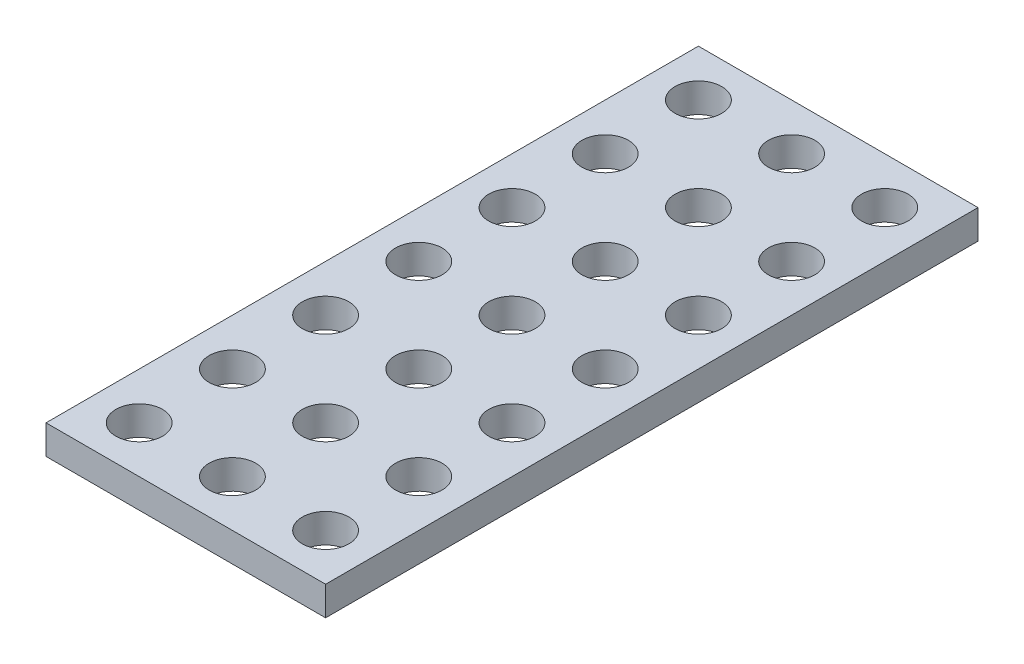
ISO-10303-21;
HEADER;
FILE_DESCRIPTION(('STEP AP214'),'2;1');
FILE_NAME('part.step','',(''),(''),'','','');
FILE_SCHEMA(('AUTOMOTIVE_DESIGN { 1 0 10303 214 1 1 1 1 }'));
ENDSEC;
DATA;
#1=APPLICATION_CONTEXT('core data for automotive mechanical design processes');
#2=APPLICATION_PROTOCOL_DEFINITION('international standard','automotive_design',2000,#1);
#3=PRODUCT_CONTEXT('',#1,'mechanical');
#4=PRODUCT('Part','Part','',(#3));
#5=PRODUCT_RELATED_PRODUCT_CATEGORY('part','',(#4));
#6=PRODUCT_DEFINITION_FORMATION('','',#4);
#7=PRODUCT_DEFINITION_CONTEXT('part definition',#1,'design');
#8=PRODUCT_DEFINITION('design','',#6,#7);
#9=PRODUCT_DEFINITION_SHAPE('','',#8);
#10=(LENGTH_UNIT() NAMED_UNIT(*) SI_UNIT(.MILLI.,.METRE.));
#11=(NAMED_UNIT(*) PLANE_ANGLE_UNIT() SI_UNIT($,.RADIAN.));
#12=(NAMED_UNIT(*) SI_UNIT($,.STERADIAN.) SOLID_ANGLE_UNIT());
#13=UNCERTAINTY_MEASURE_WITH_UNIT(LENGTH_MEASURE(1.E-05),#10,'distance_accuracy_value','');
#14=(GEOMETRIC_REPRESENTATION_CONTEXT(3) GLOBAL_UNCERTAINTY_ASSIGNED_CONTEXT((#13)) GLOBAL_UNIT_ASSIGNED_CONTEXT((#10,
#11,#12)) REPRESENTATION_CONTEXT('',''));
#15=CARTESIAN_POINT('',(0.,0.,0.));
#16=DIRECTION('',(0.,0.,1.));
#17=DIRECTION('',(1.,0.,0.));
#18=AXIS2_PLACEMENT_3D('',#15,#16,#17);
#19=CARTESIAN_POINT('',(0.,2.5,0.));
#20=DIRECTION('',(0.,1.,0.));
#21=DIRECTION('',(0.,0.,1.));
#22=AXIS2_PLACEMENT_3D('',#19,#20,#21);
#23=PLANE('',#22);
#24=CARTESIAN_POINT('',(16.,2.5,48.));
#25=DIRECTION('',(0.,-1.,0.));
#26=DIRECTION('',(0.,0.,-1.));
#27=AXIS2_PLACEMENT_3D('',#24,#25,#26);
#28=CIRCLE('',#27,2.);
#29=CARTESIAN_POINT('',(16.,2.5,46.));
#30=VERTEX_POINT('',#29);
#31=EDGE_CURVE('E139',#30,#30,#28,.T.);
#32=ORIENTED_EDGE('',*,*,#31,.T.);
#33=EDGE_LOOP('',(#32));
#34=FACE_BOUND('',#33,.T.);
#35=CARTESIAN_POINT('',(16.,2.5,40.));
#36=DIRECTION('',(0.,-1.,0.));
#37=DIRECTION('',(0.,0.,-1.));
#38=AXIS2_PLACEMENT_3D('',#35,#36,#37);
#39=CIRCLE('',#38,2.);
#40=CARTESIAN_POINT('',(16.,2.5,38.));
#41=VERTEX_POINT('',#40);
#42=EDGE_CURVE('E142',#41,#41,#39,.T.);
#43=ORIENTED_EDGE('',*,*,#42,.T.);
#44=EDGE_LOOP('',(#43));
#45=FACE_BOUND('',#44,.T.);
#46=CARTESIAN_POINT('',(16.,2.5,32.));
#47=DIRECTION('',(0.,-1.,0.));
#48=DIRECTION('',(0.,0.,-1.));
#49=AXIS2_PLACEMENT_3D('',#46,#47,#48);
#50=CIRCLE('',#49,2.);
#51=CARTESIAN_POINT('',(16.,2.5,30.));
#52=VERTEX_POINT('',#51);
#53=EDGE_CURVE('E145',#52,#52,#50,.T.);
#54=ORIENTED_EDGE('',*,*,#53,.T.);
#55=EDGE_LOOP('',(#54));
#56=FACE_BOUND('',#55,.T.);
#57=CARTESIAN_POINT('',(16.,2.5,24.));
#58=DIRECTION('',(0.,-1.,0.));
#59=DIRECTION('',(0.,0.,-1.));
#60=AXIS2_PLACEMENT_3D('',#57,#58,#59);
#61=CIRCLE('',#60,2.);
#62=CARTESIAN_POINT('',(16.,2.5,22.));
#63=VERTEX_POINT('',#62);
#64=EDGE_CURVE('E148',#63,#63,#61,.T.);
#65=ORIENTED_EDGE('',*,*,#64,.T.);
#66=EDGE_LOOP('',(#65));
#67=FACE_BOUND('',#66,.T.);
#68=CARTESIAN_POINT('',(16.,2.5,16.));
#69=DIRECTION('',(0.,-1.,0.));
#70=DIRECTION('',(0.,0.,-1.));
#71=AXIS2_PLACEMENT_3D('',#68,#69,#70);
#72=CIRCLE('',#71,2.);
#73=CARTESIAN_POINT('',(16.,2.5,14.));
#74=VERTEX_POINT('',#73);
#75=EDGE_CURVE('E151',#74,#74,#72,.T.);
#76=ORIENTED_EDGE('',*,*,#75,.T.);
#77=EDGE_LOOP('',(#76));
#78=FACE_BOUND('',#77,.T.);
#79=CARTESIAN_POINT('',(16.,2.5,8.));
#80=DIRECTION('',(0.,-1.,0.));
#81=DIRECTION('',(0.,0.,-1.));
#82=AXIS2_PLACEMENT_3D('',#79,#80,#81);
#83=CIRCLE('',#82,2.);
#84=CARTESIAN_POINT('',(16.,2.5,6.));
#85=VERTEX_POINT('',#84);
#86=EDGE_CURVE('E154',#85,#85,#83,.T.);
#87=ORIENTED_EDGE('',*,*,#86,.T.);
#88=EDGE_LOOP('',(#87));
#89=FACE_BOUND('',#88,.T.);
#90=CARTESIAN_POINT('',(16.,2.5,0.));
#91=DIRECTION('',(0.,-1.,0.));
#92=DIRECTION('',(0.,0.,-1.));
#93=AXIS2_PLACEMENT_3D('',#90,#91,#92);
#94=CIRCLE('',#93,2.);
#95=CARTESIAN_POINT('',(16.,2.5,-2.));
#96=VERTEX_POINT('',#95);
#97=EDGE_CURVE('E157',#96,#96,#94,.T.);
#98=ORIENTED_EDGE('',*,*,#97,.T.);
#99=EDGE_LOOP('',(#98));
#100=FACE_BOUND('',#99,.T.);
#101=CARTESIAN_POINT('',(8.00000000000001,2.5,48.));
#102=DIRECTION('',(0.,-1.,0.));
#103=DIRECTION('',(0.,0.,-1.));
#104=AXIS2_PLACEMENT_3D('',#101,#102,#103);
#105=CIRCLE('',#104,2.);
#106=CARTESIAN_POINT('',(8.00000000000001,2.5,46.));
#107=VERTEX_POINT('',#106);
#108=EDGE_CURVE('E160',#107,#107,#105,.T.);
#109=ORIENTED_EDGE('',*,*,#108,.T.);
#110=EDGE_LOOP('',(#109));
#111=FACE_BOUND('',#110,.T.);
#112=CARTESIAN_POINT('',(8.,2.5,40.));
#113=DIRECTION('',(0.,-1.,0.));
#114=DIRECTION('',(0.,0.,-1.));
#115=AXIS2_PLACEMENT_3D('',#112,#113,#114);
#116=CIRCLE('',#115,2.);
#117=CARTESIAN_POINT('',(8.,2.5,38.));
#118=VERTEX_POINT('',#117);
#119=EDGE_CURVE('E163',#118,#118,#116,.T.);
#120=ORIENTED_EDGE('',*,*,#119,.T.);
#121=EDGE_LOOP('',(#120));
#122=FACE_BOUND('',#121,.T.);
#123=CARTESIAN_POINT('',(8.,2.5,32.));
#124=DIRECTION('',(0.,-1.,0.));
#125=DIRECTION('',(0.,0.,-1.));
#126=AXIS2_PLACEMENT_3D('',#123,#124,#125);
#127=CIRCLE('',#126,2.);
#128=CARTESIAN_POINT('',(8.,2.5,30.));
#129=VERTEX_POINT('',#128);
#130=EDGE_CURVE('E166',#129,#129,#127,.T.);
#131=ORIENTED_EDGE('',*,*,#130,.T.);
#132=EDGE_LOOP('',(#131));
#133=FACE_BOUND('',#132,.T.);
#134=CARTESIAN_POINT('',(8.,2.5,24.));
#135=DIRECTION('',(0.,-1.,0.));
#136=DIRECTION('',(0.,0.,-1.));
#137=AXIS2_PLACEMENT_3D('',#134,#135,#136);
#138=CIRCLE('',#137,2.);
#139=CARTESIAN_POINT('',(8.,2.5,22.));
#140=VERTEX_POINT('',#139);
#141=EDGE_CURVE('E169',#140,#140,#138,.T.);
#142=ORIENTED_EDGE('',*,*,#141,.T.);
#143=EDGE_LOOP('',(#142));
#144=FACE_BOUND('',#143,.T.);
#145=CARTESIAN_POINT('',(8.,2.5,16.));
#146=DIRECTION('',(0.,-1.,0.));
#147=DIRECTION('',(0.,0.,-1.));
#148=AXIS2_PLACEMENT_3D('',#145,#146,#147);
#149=CIRCLE('',#148,2.);
#150=CARTESIAN_POINT('',(8.,2.5,14.));
#151=VERTEX_POINT('',#150);
#152=EDGE_CURVE('E172',#151,#151,#149,.T.);
#153=ORIENTED_EDGE('',*,*,#152,.T.);
#154=EDGE_LOOP('',(#153));
#155=FACE_BOUND('',#154,.T.);
#156=CARTESIAN_POINT('',(8.,2.5,8.));
#157=DIRECTION('',(0.,-1.,0.));
#158=DIRECTION('',(0.,0.,-1.));
#159=AXIS2_PLACEMENT_3D('',#156,#157,#158);
#160=CIRCLE('',#159,2.);
#161=CARTESIAN_POINT('',(8.,2.5,6.));
#162=VERTEX_POINT('',#161);
#163=EDGE_CURVE('E175',#162,#162,#160,.T.);
#164=ORIENTED_EDGE('',*,*,#163,.T.);
#165=EDGE_LOOP('',(#164));
#166=FACE_BOUND('',#165,.T.);
#167=CARTESIAN_POINT('',(8.,2.5,0.));
#168=DIRECTION('',(0.,-1.,0.));
#169=DIRECTION('',(0.,0.,-1.));
#170=AXIS2_PLACEMENT_3D('',#167,#168,#169);
#171=CIRCLE('',#170,2.);
#172=CARTESIAN_POINT('',(8.,2.5,-2.));
#173=VERTEX_POINT('',#172);
#174=EDGE_CURVE('E178',#173,#173,#171,.T.);
#175=ORIENTED_EDGE('',*,*,#174,.T.);
#176=EDGE_LOOP('',(#175));
#177=FACE_BOUND('',#176,.T.);
#178=CARTESIAN_POINT('',(0.,2.5,48.));
#179=DIRECTION('',(0.,-1.,0.));
#180=DIRECTION('',(0.,0.,-1.));
#181=AXIS2_PLACEMENT_3D('',#178,#179,#180);
#182=CIRCLE('',#181,2.);
#183=CARTESIAN_POINT('',(0.,2.5,46.));
#184=VERTEX_POINT('',#183);
#185=EDGE_CURVE('E181',#184,#184,#182,.T.);
#186=ORIENTED_EDGE('',*,*,#185,.T.);
#187=EDGE_LOOP('',(#186));
#188=FACE_BOUND('',#187,.T.);
#189=CARTESIAN_POINT('',(0.,2.5,40.));
#190=DIRECTION('',(0.,-1.,0.));
#191=DIRECTION('',(0.,0.,-1.));
#192=AXIS2_PLACEMENT_3D('',#189,#190,#191);
#193=CIRCLE('',#192,2.);
#194=CARTESIAN_POINT('',(0.,2.5,38.));
#195=VERTEX_POINT('',#194);
#196=EDGE_CURVE('E184',#195,#195,#193,.T.);
#197=ORIENTED_EDGE('',*,*,#196,.T.);
#198=EDGE_LOOP('',(#197));
#199=FACE_BOUND('',#198,.T.);
#200=CARTESIAN_POINT('',(0.,2.5,32.));
#201=DIRECTION('',(0.,-1.,0.));
#202=DIRECTION('',(0.,0.,-1.));
#203=AXIS2_PLACEMENT_3D('',#200,#201,#202);
#204=CIRCLE('',#203,2.);
#205=CARTESIAN_POINT('',(0.,2.5,30.));
#206=VERTEX_POINT('',#205);
#207=EDGE_CURVE('E187',#206,#206,#204,.T.);
#208=ORIENTED_EDGE('',*,*,#207,.T.);
#209=EDGE_LOOP('',(#208));
#210=FACE_BOUND('',#209,.T.);
#211=CARTESIAN_POINT('',(0.,2.5,24.));
#212=DIRECTION('',(0.,-1.,0.));
#213=DIRECTION('',(0.,0.,-1.));
#214=AXIS2_PLACEMENT_3D('',#211,#212,#213);
#215=CIRCLE('',#214,2.);
#216=CARTESIAN_POINT('',(0.,2.5,22.));
#217=VERTEX_POINT('',#216);
#218=EDGE_CURVE('E190',#217,#217,#215,.T.);
#219=ORIENTED_EDGE('',*,*,#218,.T.);
#220=EDGE_LOOP('',(#219));
#221=FACE_BOUND('',#220,.T.);
#222=CARTESIAN_POINT('',(0.,2.5,16.));
#223=DIRECTION('',(0.,-1.,0.));
#224=DIRECTION('',(0.,0.,-1.));
#225=AXIS2_PLACEMENT_3D('',#222,#223,#224);
#226=CIRCLE('',#225,2.);
#227=CARTESIAN_POINT('',(0.,2.5,14.));
#228=VERTEX_POINT('',#227);
#229=EDGE_CURVE('E193',#228,#228,#226,.T.);
#230=ORIENTED_EDGE('',*,*,#229,.T.);
#231=EDGE_LOOP('',(#230));
#232=FACE_BOUND('',#231,.T.);
#233=CARTESIAN_POINT('',(0.,2.5,8.));
#234=DIRECTION('',(0.,-1.,0.));
#235=DIRECTION('',(0.,0.,-1.));
#236=AXIS2_PLACEMENT_3D('',#233,#234,#235);
#237=CIRCLE('',#236,2.);
#238=CARTESIAN_POINT('',(0.,2.5,6.));
#239=VERTEX_POINT('',#238);
#240=EDGE_CURVE('E195',#239,#239,#237,.T.);
#241=ORIENTED_EDGE('',*,*,#240,.T.);
#242=EDGE_LOOP('',(#241));
#243=FACE_BOUND('',#242,.T.);
#244=CARTESIAN_POINT('',(0.,2.5,0.));
#245=DIRECTION('',(0.,-1.,0.));
#246=DIRECTION('',(0.,0.,-1.));
#247=AXIS2_PLACEMENT_3D('',#244,#245,#246);
#248=CIRCLE('',#247,2.);
#249=CARTESIAN_POINT('',(0.,2.5,-2.));
#250=VERTEX_POINT('',#249);
#251=EDGE_CURVE('E19',#250,#250,#248,.T.);
#252=ORIENTED_EDGE('',*,*,#251,.T.);
#253=EDGE_LOOP('',(#252));
#254=FACE_BOUND('',#253,.T.);
#255=DIRECTION('',(0.,0.,-1.));
#256=VECTOR('',#255,1.);
#257=CARTESIAN_POINT('',(-4.,2.5,-4.));
#258=LINE('',#257,#256);
#259=CARTESIAN_POINT('',(-4.,2.5,-4.));
#260=VERTEX_POINT('',#259);
#261=CARTESIAN_POINT('',(-4.,2.5,52.));
#262=VERTEX_POINT('',#261);
#263=EDGE_CURVE('E58',#260,#262,#258,.F.);
#264=ORIENTED_EDGE('',*,*,#263,.T.);
#265=DIRECTION('',(-1.,0.,0.));
#266=VECTOR('',#265,1.);
#267=CARTESIAN_POINT('',(-3.99999999999999,2.5,52.));
#268=LINE('',#267,#266);
#269=CARTESIAN_POINT('',(20.,2.5,52.));
#270=VERTEX_POINT('',#269);
#271=EDGE_CURVE('E55',#262,#270,#268,.F.);
#272=ORIENTED_EDGE('',*,*,#271,.T.);
#273=DIRECTION('',(0.,0.,1.));
#274=VECTOR('',#273,1.);
#275=CARTESIAN_POINT('',(20.,2.5,-4.));
#276=LINE('',#275,#274);
#277=CARTESIAN_POINT('',(20.,2.5,-4.));
#278=VERTEX_POINT('',#277);
#279=EDGE_CURVE('E209',#270,#278,#276,.F.);
#280=ORIENTED_EDGE('',*,*,#279,.T.);
#281=DIRECTION('',(1.,0.,0.));
#282=VECTOR('',#281,1.);
#283=CARTESIAN_POINT('',(-4.,2.5,-4.));
#284=LINE('',#283,#282);
#285=EDGE_CURVE('E59',#278,#260,#284,.F.);
#286=ORIENTED_EDGE('',*,*,#285,.T.);
#287=EDGE_LOOP('',(#264,#272,#280,#286));
#288=FACE_BOUND('',#287,.T.);
#289=ADVANCED_FACE('F16',(#34,#45,#56,#67,#78,#89,#100,#111,#122,#133,#144,#155,#166,#177,#188,
#199,#210,#221,#232,#243,#254,#288),#23,.T.);
#290=CARTESIAN_POINT('',(-4.,2.5,-4.));
#291=DIRECTION('',(1.,0.,0.));
#292=DIRECTION('',(0.,0.,-1.));
#293=AXIS2_PLACEMENT_3D('',#290,#291,#292);
#294=PLANE('',#293);
#295=DIRECTION('',(0.,1.,0.));
#296=VECTOR('',#295,1.);
#297=CARTESIAN_POINT('',(-3.99999999999999,2.5,52.));
#298=LINE('',#297,#296);
#299=CARTESIAN_POINT('',(-4.,0.,52.));
#300=VERTEX_POINT('',#299);
#301=EDGE_CURVE('E64',#300,#262,#298,.T.);
#302=ORIENTED_EDGE('',*,*,#301,.T.);
#303=ORIENTED_EDGE('',*,*,#263,.F.);
#304=DIRECTION('',(0.,1.,0.));
#305=VECTOR('',#304,1.);
#306=CARTESIAN_POINT('',(-4.,2.5,-4.));
#307=LINE('',#306,#305);
#308=CARTESIAN_POINT('',(-4.,0.,-4.));
#309=VERTEX_POINT('',#308);
#310=EDGE_CURVE('E200',#260,#309,#307,.F.);
#311=ORIENTED_EDGE('',*,*,#310,.T.);
#312=DIRECTION('',(0.,0.,1.));
#313=VECTOR('',#312,1.);
#314=CARTESIAN_POINT('',(-4.,0.,0.));
#315=LINE('',#314,#313);
#316=EDGE_CURVE('E75',#309,#300,#315,.T.);
#317=ORIENTED_EDGE('',*,*,#316,.T.);
#318=EDGE_LOOP('',(#302,#303,#311,#317));
#319=FACE_BOUND('',#318,.T.);
#320=ADVANCED_FACE('F74',(#319),#294,.F.);
#321=CARTESIAN_POINT('',(-3.99999999999999,2.5,52.));
#322=DIRECTION('',(0.,0.,-1.));
#323=DIRECTION('',(-1.,0.,0.));
#324=AXIS2_PLACEMENT_3D('',#321,#322,#323);
#325=PLANE('',#324);
#326=DIRECTION('',(0.,1.,0.));
#327=VECTOR('',#326,1.);
#328=CARTESIAN_POINT('',(20.,2.5,52.));
#329=LINE('',#328,#327);
#330=CARTESIAN_POINT('',(20.,0.,52.));
#331=VERTEX_POINT('',#330);
#332=EDGE_CURVE('E71',#331,#270,#329,.T.);
#333=ORIENTED_EDGE('',*,*,#332,.T.);
#334=ORIENTED_EDGE('',*,*,#271,.F.);
#335=ORIENTED_EDGE('',*,*,#301,.F.);
#336=DIRECTION('',(1.,0.,0.));
#337=VECTOR('',#336,1.);
#338=CARTESIAN_POINT('',(0.,0.,52.));
#339=LINE('',#338,#337);
#340=EDGE_CURVE('E217',#300,#331,#339,.T.);
#341=ORIENTED_EDGE('',*,*,#340,.T.);
#342=EDGE_LOOP('',(#333,#334,#335,#341));
#343=FACE_BOUND('',#342,.T.);
#344=ADVANCED_FACE('F68',(#343),#325,.F.);
#345=CARTESIAN_POINT('',(20.,2.5,-4.));
#346=DIRECTION('',(-1.,0.,0.));
#347=DIRECTION('',(0.,0.,1.));
#348=AXIS2_PLACEMENT_3D('',#345,#346,#347);
#349=PLANE('',#348);
#350=DIRECTION('',(0.,1.,0.));
#351=VECTOR('',#350,1.);
#352=CARTESIAN_POINT('',(20.,2.5,-4.));
#353=LINE('',#352,#351);
#354=CARTESIAN_POINT('',(20.,0.,-4.));
#355=VERTEX_POINT('',#354);
#356=EDGE_CURVE('E34',#355,#278,#353,.T.);
#357=ORIENTED_EDGE('',*,*,#356,.T.);
#358=ORIENTED_EDGE('',*,*,#279,.F.);
#359=ORIENTED_EDGE('',*,*,#332,.F.);
#360=DIRECTION('',(0.,0.,1.));
#361=VECTOR('',#360,1.);
#362=CARTESIAN_POINT('',(20.,0.,0.));
#363=LINE('',#362,#361);
#364=EDGE_CURVE('E215',#331,#355,#363,.F.);
#365=ORIENTED_EDGE('',*,*,#364,.T.);
#366=EDGE_LOOP('',(#357,#358,#359,#365));
#367=FACE_BOUND('',#366,.T.);
#368=ADVANCED_FACE('F213',(#367),#349,.F.);
#369=CARTESIAN_POINT('',(-4.,2.5,-4.));
#370=DIRECTION('',(0.,0.,1.));
#371=DIRECTION('',(1.,0.,0.));
#372=AXIS2_PLACEMENT_3D('',#369,#370,#371);
#373=PLANE('',#372);
#374=ORIENTED_EDGE('',*,*,#310,.F.);
#375=ORIENTED_EDGE('',*,*,#285,.F.);
#376=ORIENTED_EDGE('',*,*,#356,.F.);
#377=DIRECTION('',(1.,0.,0.));
#378=VECTOR('',#377,1.);
#379=CARTESIAN_POINT('',(0.,0.,-4.));
#380=LINE('',#379,#378);
#381=EDGE_CURVE('E138',#355,#309,#380,.F.);
#382=ORIENTED_EDGE('',*,*,#381,.T.);
#383=EDGE_LOOP('',(#374,#375,#376,#382));
#384=FACE_BOUND('',#383,.T.);
#385=ADVANCED_FACE('F211',(#384),#373,.F.);
#386=CARTESIAN_POINT('',(0.,2.5,0.));
#387=DIRECTION('',(0.,-1.,0.));
#388=DIRECTION('',(0.,0.,-1.));
#389=AXIS2_PLACEMENT_3D('',#386,#387,#388);
#390=CYLINDRICAL_SURFACE('',#389,2.);
#391=CARTESIAN_POINT('',(0.,0.,0.));
#392=DIRECTION('',(0.,-1.,0.));
#393=DIRECTION('',(0.,0.,-1.));
#394=AXIS2_PLACEMENT_3D('',#391,#392,#393);
#395=CIRCLE('',#394,2.);
#396=CARTESIAN_POINT('',(0.,0.,-2.));
#397=VERTEX_POINT('',#396);
#398=EDGE_CURVE('E135',#397,#397,#395,.T.);
#399=ORIENTED_EDGE('',*,*,#398,.T.);
#400=EDGE_LOOP('',(#399));
#401=FACE_BOUND('',#400,.T.);
#402=ORIENTED_EDGE('',*,*,#251,.F.);
#403=EDGE_LOOP('',(#402));
#404=FACE_BOUND('',#403,.T.);
#405=ADVANCED_FACE('F309',(#401,#404),#390,.F.);
#406=CARTESIAN_POINT('',(0.,2.5,8.));
#407=DIRECTION('',(0.,-1.,0.));
#408=DIRECTION('',(0.,0.,-1.));
#409=AXIS2_PLACEMENT_3D('',#406,#407,#408);
#410=CYLINDRICAL_SURFACE('',#409,2.);
#411=CARTESIAN_POINT('',(0.,0.,8.));
#412=DIRECTION('',(0.,-1.,0.));
#413=DIRECTION('',(0.,0.,-1.));
#414=AXIS2_PLACEMENT_3D('',#411,#412,#413);
#415=CIRCLE('',#414,2.);
#416=CARTESIAN_POINT('',(0.,0.,6.));
#417=VERTEX_POINT('',#416);
#418=EDGE_CURVE('E132',#417,#417,#415,.T.);
#419=ORIENTED_EDGE('',*,*,#418,.T.);
#420=EDGE_LOOP('',(#419));
#421=FACE_BOUND('',#420,.T.);
#422=ORIENTED_EDGE('',*,*,#240,.F.);
#423=EDGE_LOOP('',(#422));
#424=FACE_BOUND('',#423,.T.);
#425=ADVANCED_FACE('F305',(#421,#424),#410,.F.);
#426=CARTESIAN_POINT('',(0.,2.5,16.));
#427=DIRECTION('',(0.,-1.,0.));
#428=DIRECTION('',(0.,0.,-1.));
#429=AXIS2_PLACEMENT_3D('',#426,#427,#428);
#430=CYLINDRICAL_SURFACE('',#429,2.);
#431=CARTESIAN_POINT('',(0.,0.,16.));
#432=DIRECTION('',(0.,-1.,0.));
#433=DIRECTION('',(0.,0.,-1.));
#434=AXIS2_PLACEMENT_3D('',#431,#432,#433);
#435=CIRCLE('',#434,2.);
#436=CARTESIAN_POINT('',(0.,0.,14.));
#437=VERTEX_POINT('',#436);
#438=EDGE_CURVE('E129',#437,#437,#435,.T.);
#439=ORIENTED_EDGE('',*,*,#438,.T.);
#440=EDGE_LOOP('',(#439));
#441=FACE_BOUND('',#440,.T.);
#442=ORIENTED_EDGE('',*,*,#229,.F.);
#443=EDGE_LOOP('',(#442));
#444=FACE_BOUND('',#443,.T.);
#445=ADVANCED_FACE('F301',(#441,#444),#430,.F.);
#446=CARTESIAN_POINT('',(0.,2.5,24.));
#447=DIRECTION('',(0.,-1.,0.));
#448=DIRECTION('',(0.,0.,-1.));
#449=AXIS2_PLACEMENT_3D('',#446,#447,#448);
#450=CYLINDRICAL_SURFACE('',#449,2.);
#451=CARTESIAN_POINT('',(0.,0.,24.));
#452=DIRECTION('',(0.,-1.,0.));
#453=DIRECTION('',(0.,0.,-1.));
#454=AXIS2_PLACEMENT_3D('',#451,#452,#453);
#455=CIRCLE('',#454,2.);
#456=CARTESIAN_POINT('',(0.,0.,22.));
#457=VERTEX_POINT('',#456);
#458=EDGE_CURVE('E126',#457,#457,#455,.T.);
#459=ORIENTED_EDGE('',*,*,#458,.T.);
#460=EDGE_LOOP('',(#459));
#461=FACE_BOUND('',#460,.T.);
#462=ORIENTED_EDGE('',*,*,#218,.F.);
#463=EDGE_LOOP('',(#462));
#464=FACE_BOUND('',#463,.T.);
#465=ADVANCED_FACE('F297',(#461,#464),#450,.F.);
#466=CARTESIAN_POINT('',(0.,2.5,32.));
#467=DIRECTION('',(0.,-1.,0.));
#468=DIRECTION('',(0.,0.,-1.));
#469=AXIS2_PLACEMENT_3D('',#466,#467,#468);
#470=CYLINDRICAL_SURFACE('',#469,2.);
#471=CARTESIAN_POINT('',(0.,0.,32.));
#472=DIRECTION('',(0.,-1.,0.));
#473=DIRECTION('',(0.,0.,-1.));
#474=AXIS2_PLACEMENT_3D('',#471,#472,#473);
#475=CIRCLE('',#474,2.);
#476=CARTESIAN_POINT('',(0.,0.,30.));
#477=VERTEX_POINT('',#476);
#478=EDGE_CURVE('E123',#477,#477,#475,.T.);
#479=ORIENTED_EDGE('',*,*,#478,.T.);
#480=EDGE_LOOP('',(#479));
#481=FACE_BOUND('',#480,.T.);
#482=ORIENTED_EDGE('',*,*,#207,.F.);
#483=EDGE_LOOP('',(#482));
#484=FACE_BOUND('',#483,.T.);
#485=ADVANCED_FACE('F293',(#481,#484),#470,.F.);
#486=CARTESIAN_POINT('',(0.,2.5,40.));
#487=DIRECTION('',(0.,-1.,0.));
#488=DIRECTION('',(0.,0.,-1.));
#489=AXIS2_PLACEMENT_3D('',#486,#487,#488);
#490=CYLINDRICAL_SURFACE('',#489,2.);
#491=CARTESIAN_POINT('',(0.,0.,40.));
#492=DIRECTION('',(0.,-1.,0.));
#493=DIRECTION('',(0.,0.,-1.));
#494=AXIS2_PLACEMENT_3D('',#491,#492,#493);
#495=CIRCLE('',#494,2.);
#496=CARTESIAN_POINT('',(0.,0.,38.));
#497=VERTEX_POINT('',#496);
#498=EDGE_CURVE('E120',#497,#497,#495,.T.);
#499=ORIENTED_EDGE('',*,*,#498,.T.);
#500=EDGE_LOOP('',(#499));
#501=FACE_BOUND('',#500,.T.);
#502=ORIENTED_EDGE('',*,*,#196,.F.);
#503=EDGE_LOOP('',(#502));
#504=FACE_BOUND('',#503,.T.);
#505=ADVANCED_FACE('F289',(#501,#504),#490,.F.);
#506=CARTESIAN_POINT('',(0.,2.5,48.));
#507=DIRECTION('',(0.,-1.,0.));
#508=DIRECTION('',(0.,0.,-1.));
#509=AXIS2_PLACEMENT_3D('',#506,#507,#508);
#510=CYLINDRICAL_SURFACE('',#509,2.);
#511=CARTESIAN_POINT('',(0.,0.,48.));
#512=DIRECTION('',(0.,-1.,0.));
#513=DIRECTION('',(0.,0.,-1.));
#514=AXIS2_PLACEMENT_3D('',#511,#512,#513);
#515=CIRCLE('',#514,2.);
#516=CARTESIAN_POINT('',(0.,0.,46.));
#517=VERTEX_POINT('',#516);
#518=EDGE_CURVE('E117',#517,#517,#515,.T.);
#519=ORIENTED_EDGE('',*,*,#518,.T.);
#520=EDGE_LOOP('',(#519));
#521=FACE_BOUND('',#520,.T.);
#522=ORIENTED_EDGE('',*,*,#185,.F.);
#523=EDGE_LOOP('',(#522));
#524=FACE_BOUND('',#523,.T.);
#525=ADVANCED_FACE('F285',(#521,#524),#510,.F.);
#526=CARTESIAN_POINT('',(8.,2.5,0.));
#527=DIRECTION('',(0.,-1.,0.));
#528=DIRECTION('',(0.,0.,-1.));
#529=AXIS2_PLACEMENT_3D('',#526,#527,#528);
#530=CYLINDRICAL_SURFACE('',#529,2.);
#531=CARTESIAN_POINT('',(8.,0.,0.));
#532=DIRECTION('',(0.,-1.,0.));
#533=DIRECTION('',(0.,0.,-1.));
#534=AXIS2_PLACEMENT_3D('',#531,#532,#533);
#535=CIRCLE('',#534,2.);
#536=CARTESIAN_POINT('',(8.,0.,-2.));
#537=VERTEX_POINT('',#536);
#538=EDGE_CURVE('E114',#537,#537,#535,.T.);
#539=ORIENTED_EDGE('',*,*,#538,.T.);
#540=EDGE_LOOP('',(#539));
#541=FACE_BOUND('',#540,.T.);
#542=ORIENTED_EDGE('',*,*,#174,.F.);
#543=EDGE_LOOP('',(#542));
#544=FACE_BOUND('',#543,.T.);
#545=ADVANCED_FACE('F281',(#541,#544),#530,.F.);
#546=CARTESIAN_POINT('',(8.,2.5,8.));
#547=DIRECTION('',(0.,-1.,0.));
#548=DIRECTION('',(0.,0.,-1.));
#549=AXIS2_PLACEMENT_3D('',#546,#547,#548);
#550=CYLINDRICAL_SURFACE('',#549,2.);
#551=CARTESIAN_POINT('',(8.,0.,8.));
#552=DIRECTION('',(0.,-1.,0.));
#553=DIRECTION('',(0.,0.,-1.));
#554=AXIS2_PLACEMENT_3D('',#551,#552,#553);
#555=CIRCLE('',#554,2.);
#556=CARTESIAN_POINT('',(8.,0.,6.));
#557=VERTEX_POINT('',#556);
#558=EDGE_CURVE('E111',#557,#557,#555,.T.);
#559=ORIENTED_EDGE('',*,*,#558,.T.);
#560=EDGE_LOOP('',(#559));
#561=FACE_BOUND('',#560,.T.);
#562=ORIENTED_EDGE('',*,*,#163,.F.);
#563=EDGE_LOOP('',(#562));
#564=FACE_BOUND('',#563,.T.);
#565=ADVANCED_FACE('F277',(#561,#564),#550,.F.);
#566=CARTESIAN_POINT('',(8.,2.5,16.));
#567=DIRECTION('',(0.,-1.,0.));
#568=DIRECTION('',(0.,0.,-1.));
#569=AXIS2_PLACEMENT_3D('',#566,#567,#568);
#570=CYLINDRICAL_SURFACE('',#569,2.);
#571=CARTESIAN_POINT('',(8.,0.,16.));
#572=DIRECTION('',(0.,-1.,0.));
#573=DIRECTION('',(0.,0.,-1.));
#574=AXIS2_PLACEMENT_3D('',#571,#572,#573);
#575=CIRCLE('',#574,2.);
#576=CARTESIAN_POINT('',(8.,0.,14.));
#577=VERTEX_POINT('',#576);
#578=EDGE_CURVE('E108',#577,#577,#575,.T.);
#579=ORIENTED_EDGE('',*,*,#578,.T.);
#580=EDGE_LOOP('',(#579));
#581=FACE_BOUND('',#580,.T.);
#582=ORIENTED_EDGE('',*,*,#152,.F.);
#583=EDGE_LOOP('',(#582));
#584=FACE_BOUND('',#583,.T.);
#585=ADVANCED_FACE('F273',(#581,#584),#570,.F.);
#586=CARTESIAN_POINT('',(8.,2.5,24.));
#587=DIRECTION('',(0.,-1.,0.));
#588=DIRECTION('',(0.,0.,-1.));
#589=AXIS2_PLACEMENT_3D('',#586,#587,#588);
#590=CYLINDRICAL_SURFACE('',#589,2.);
#591=CARTESIAN_POINT('',(8.,0.,24.));
#592=DIRECTION('',(0.,-1.,0.));
#593=DIRECTION('',(0.,0.,-1.));
#594=AXIS2_PLACEMENT_3D('',#591,#592,#593);
#595=CIRCLE('',#594,2.);
#596=CARTESIAN_POINT('',(8.,0.,22.));
#597=VERTEX_POINT('',#596);
#598=EDGE_CURVE('E105',#597,#597,#595,.T.);
#599=ORIENTED_EDGE('',*,*,#598,.T.);
#600=EDGE_LOOP('',(#599));
#601=FACE_BOUND('',#600,.T.);
#602=ORIENTED_EDGE('',*,*,#141,.F.);
#603=EDGE_LOOP('',(#602));
#604=FACE_BOUND('',#603,.T.);
#605=ADVANCED_FACE('F269',(#601,#604),#590,.F.);
#606=CARTESIAN_POINT('',(8.,2.5,32.));
#607=DIRECTION('',(0.,-1.,0.));
#608=DIRECTION('',(0.,0.,-1.));
#609=AXIS2_PLACEMENT_3D('',#606,#607,#608);
#610=CYLINDRICAL_SURFACE('',#609,2.);
#611=CARTESIAN_POINT('',(8.,0.,32.));
#612=DIRECTION('',(0.,-1.,0.));
#613=DIRECTION('',(0.,0.,-1.));
#614=AXIS2_PLACEMENT_3D('',#611,#612,#613);
#615=CIRCLE('',#614,2.);
#616=CARTESIAN_POINT('',(8.,0.,30.));
#617=VERTEX_POINT('',#616);
#618=EDGE_CURVE('E102',#617,#617,#615,.T.);
#619=ORIENTED_EDGE('',*,*,#618,.T.);
#620=EDGE_LOOP('',(#619));
#621=FACE_BOUND('',#620,.T.);
#622=ORIENTED_EDGE('',*,*,#130,.F.);
#623=EDGE_LOOP('',(#622));
#624=FACE_BOUND('',#623,.T.);
#625=ADVANCED_FACE('F265',(#621,#624),#610,.F.);
#626=CARTESIAN_POINT('',(8.,2.5,40.));
#627=DIRECTION('',(0.,-1.,0.));
#628=DIRECTION('',(0.,0.,-1.));
#629=AXIS2_PLACEMENT_3D('',#626,#627,#628);
#630=CYLINDRICAL_SURFACE('',#629,2.);
#631=CARTESIAN_POINT('',(8.,0.,40.));
#632=DIRECTION('',(0.,-1.,0.));
#633=DIRECTION('',(0.,0.,-1.));
#634=AXIS2_PLACEMENT_3D('',#631,#632,#633);
#635=CIRCLE('',#634,2.);
#636=CARTESIAN_POINT('',(8.,0.,38.));
#637=VERTEX_POINT('',#636);
#638=EDGE_CURVE('E99',#637,#637,#635,.T.);
#639=ORIENTED_EDGE('',*,*,#638,.T.);
#640=EDGE_LOOP('',(#639));
#641=FACE_BOUND('',#640,.T.);
#642=ORIENTED_EDGE('',*,*,#119,.F.);
#643=EDGE_LOOP('',(#642));
#644=FACE_BOUND('',#643,.T.);
#645=ADVANCED_FACE('F261',(#641,#644),#630,.F.);
#646=CARTESIAN_POINT('',(8.00000000000001,2.5,48.));
#647=DIRECTION('',(0.,-1.,0.));
#648=DIRECTION('',(0.,0.,-1.));
#649=AXIS2_PLACEMENT_3D('',#646,#647,#648);
#650=CYLINDRICAL_SURFACE('',#649,2.);
#651=CARTESIAN_POINT('',(8.00000000000001,0.,48.));
#652=DIRECTION('',(0.,-1.,0.));
#653=DIRECTION('',(0.,0.,-1.));
#654=AXIS2_PLACEMENT_3D('',#651,#652,#653);
#655=CIRCLE('',#654,2.);
#656=CARTESIAN_POINT('',(8.00000000000001,0.,46.));
#657=VERTEX_POINT('',#656);
#658=EDGE_CURVE('E96',#657,#657,#655,.T.);
#659=ORIENTED_EDGE('',*,*,#658,.T.);
#660=EDGE_LOOP('',(#659));
#661=FACE_BOUND('',#660,.T.);
#662=ORIENTED_EDGE('',*,*,#108,.F.);
#663=EDGE_LOOP('',(#662));
#664=FACE_BOUND('',#663,.T.);
#665=ADVANCED_FACE('F257',(#661,#664),#650,.F.);
#666=CARTESIAN_POINT('',(16.,2.5,0.));
#667=DIRECTION('',(0.,-1.,0.));
#668=DIRECTION('',(0.,0.,-1.));
#669=AXIS2_PLACEMENT_3D('',#666,#667,#668);
#670=CYLINDRICAL_SURFACE('',#669,2.);
#671=CARTESIAN_POINT('',(16.,0.,0.));
#672=DIRECTION('',(0.,-1.,0.));
#673=DIRECTION('',(0.,0.,-1.));
#674=AXIS2_PLACEMENT_3D('',#671,#672,#673);
#675=CIRCLE('',#674,2.);
#676=CARTESIAN_POINT('',(16.,0.,-2.));
#677=VERTEX_POINT('',#676);
#678=EDGE_CURVE('E93',#677,#677,#675,.T.);
#679=ORIENTED_EDGE('',*,*,#678,.T.);
#680=EDGE_LOOP('',(#679));
#681=FACE_BOUND('',#680,.T.);
#682=ORIENTED_EDGE('',*,*,#97,.F.);
#683=EDGE_LOOP('',(#682));
#684=FACE_BOUND('',#683,.T.);
#685=ADVANCED_FACE('F253',(#681,#684),#670,.F.);
#686=CARTESIAN_POINT('',(16.,2.5,8.));
#687=DIRECTION('',(0.,-1.,0.));
#688=DIRECTION('',(0.,0.,-1.));
#689=AXIS2_PLACEMENT_3D('',#686,#687,#688);
#690=CYLINDRICAL_SURFACE('',#689,2.);
#691=CARTESIAN_POINT('',(16.,0.,8.));
#692=DIRECTION('',(0.,-1.,0.));
#693=DIRECTION('',(0.,0.,-1.));
#694=AXIS2_PLACEMENT_3D('',#691,#692,#693);
#695=CIRCLE('',#694,2.);
#696=CARTESIAN_POINT('',(16.,0.,6.));
#697=VERTEX_POINT('',#696);
#698=EDGE_CURVE('E90',#697,#697,#695,.T.);
#699=ORIENTED_EDGE('',*,*,#698,.T.);
#700=EDGE_LOOP('',(#699));
#701=FACE_BOUND('',#700,.T.);
#702=ORIENTED_EDGE('',*,*,#86,.F.);
#703=EDGE_LOOP('',(#702));
#704=FACE_BOUND('',#703,.T.);
#705=ADVANCED_FACE('F249',(#701,#704),#690,.F.);
#706=CARTESIAN_POINT('',(16.,2.5,16.));
#707=DIRECTION('',(0.,-1.,0.));
#708=DIRECTION('',(0.,0.,-1.));
#709=AXIS2_PLACEMENT_3D('',#706,#707,#708);
#710=CYLINDRICAL_SURFACE('',#709,2.);
#711=CARTESIAN_POINT('',(16.,0.,16.));
#712=DIRECTION('',(0.,-1.,0.));
#713=DIRECTION('',(0.,0.,-1.));
#714=AXIS2_PLACEMENT_3D('',#711,#712,#713);
#715=CIRCLE('',#714,2.);
#716=CARTESIAN_POINT('',(16.,0.,14.));
#717=VERTEX_POINT('',#716);
#718=EDGE_CURVE('E87',#717,#717,#715,.T.);
#719=ORIENTED_EDGE('',*,*,#718,.T.);
#720=EDGE_LOOP('',(#719));
#721=FACE_BOUND('',#720,.T.);
#722=ORIENTED_EDGE('',*,*,#75,.F.);
#723=EDGE_LOOP('',(#722));
#724=FACE_BOUND('',#723,.T.);
#725=ADVANCED_FACE('F245',(#721,#724),#710,.F.);
#726=CARTESIAN_POINT('',(16.,2.5,24.));
#727=DIRECTION('',(0.,-1.,0.));
#728=DIRECTION('',(0.,0.,-1.));
#729=AXIS2_PLACEMENT_3D('',#726,#727,#728);
#730=CYLINDRICAL_SURFACE('',#729,2.);
#731=CARTESIAN_POINT('',(16.,0.,24.));
#732=DIRECTION('',(0.,-1.,0.));
#733=DIRECTION('',(0.,0.,-1.));
#734=AXIS2_PLACEMENT_3D('',#731,#732,#733);
#735=CIRCLE('',#734,2.);
#736=CARTESIAN_POINT('',(16.,0.,22.));
#737=VERTEX_POINT('',#736);
#738=EDGE_CURVE('E84',#737,#737,#735,.T.);
#739=ORIENTED_EDGE('',*,*,#738,.T.);
#740=EDGE_LOOP('',(#739));
#741=FACE_BOUND('',#740,.T.);
#742=ORIENTED_EDGE('',*,*,#64,.F.);
#743=EDGE_LOOP('',(#742));
#744=FACE_BOUND('',#743,.T.);
#745=ADVANCED_FACE('F241',(#741,#744),#730,.F.);
#746=CARTESIAN_POINT('',(16.,2.5,32.));
#747=DIRECTION('',(0.,-1.,0.));
#748=DIRECTION('',(0.,0.,-1.));
#749=AXIS2_PLACEMENT_3D('',#746,#747,#748);
#750=CYLINDRICAL_SURFACE('',#749,2.);
#751=CARTESIAN_POINT('',(16.,0.,32.));
#752=DIRECTION('',(0.,-1.,0.));
#753=DIRECTION('',(0.,0.,-1.));
#754=AXIS2_PLACEMENT_3D('',#751,#752,#753);
#755=CIRCLE('',#754,2.);
#756=CARTESIAN_POINT('',(16.,0.,30.));
#757=VERTEX_POINT('',#756);
#758=EDGE_CURVE('E81',#757,#757,#755,.T.);
#759=ORIENTED_EDGE('',*,*,#758,.T.);
#760=EDGE_LOOP('',(#759));
#761=FACE_BOUND('',#760,.T.);
#762=ORIENTED_EDGE('',*,*,#53,.F.);
#763=EDGE_LOOP('',(#762));
#764=FACE_BOUND('',#763,.T.);
#765=ADVANCED_FACE('F237',(#761,#764),#750,.F.);
#766=CARTESIAN_POINT('',(16.,2.5,40.));
#767=DIRECTION('',(0.,-1.,0.));
#768=DIRECTION('',(0.,0.,-1.));
#769=AXIS2_PLACEMENT_3D('',#766,#767,#768);
#770=CYLINDRICAL_SURFACE('',#769,2.);
#771=CARTESIAN_POINT('',(16.,0.,40.));
#772=DIRECTION('',(0.,-1.,0.));
#773=DIRECTION('',(0.,0.,-1.));
#774=AXIS2_PLACEMENT_3D('',#771,#772,#773);
#775=CIRCLE('',#774,2.);
#776=CARTESIAN_POINT('',(16.,0.,38.));
#777=VERTEX_POINT('',#776);
#778=EDGE_CURVE('E25',#777,#777,#775,.T.);
#779=ORIENTED_EDGE('',*,*,#778,.T.);
#780=EDGE_LOOP('',(#779));
#781=FACE_BOUND('',#780,.T.);
#782=ORIENTED_EDGE('',*,*,#42,.F.);
#783=EDGE_LOOP('',(#782));
#784=FACE_BOUND('',#783,.T.);
#785=ADVANCED_FACE('F229',(#781,#784),#770,.F.);
#786=CARTESIAN_POINT('',(16.,2.5,48.));
#787=DIRECTION('',(0.,-1.,0.));
#788=DIRECTION('',(0.,0.,-1.));
#789=AXIS2_PLACEMENT_3D('',#786,#787,#788);
#790=CYLINDRICAL_SURFACE('',#789,2.);
#791=CARTESIAN_POINT('',(16.,0.,48.));
#792=DIRECTION('',(0.,-1.,0.));
#793=DIRECTION('',(0.,0.,-1.));
#794=AXIS2_PLACEMENT_3D('',#791,#792,#793);
#795=CIRCLE('',#794,2.);
#796=CARTESIAN_POINT('',(16.,0.,46.));
#797=VERTEX_POINT('',#796);
#798=EDGE_CURVE('E11',#797,#797,#795,.T.);
#799=ORIENTED_EDGE('',*,*,#798,.T.);
#800=EDGE_LOOP('',(#799));
#801=FACE_BOUND('',#800,.T.);
#802=ORIENTED_EDGE('',*,*,#31,.F.);
#803=EDGE_LOOP('',(#802));
#804=FACE_BOUND('',#803,.T.);
#805=ADVANCED_FACE('F222',(#801,#804),#790,.F.);
#806=CARTESIAN_POINT('',(0.,0.,0.));
#807=DIRECTION('',(0.,1.,0.));
#808=DIRECTION('',(0.,0.,1.));
#809=AXIS2_PLACEMENT_3D('',#806,#807,#808);
#810=PLANE('',#809);
#811=ORIENTED_EDGE('',*,*,#798,.F.);
#812=EDGE_LOOP('',(#811));
#813=FACE_BOUND('',#812,.T.);
#814=ORIENTED_EDGE('',*,*,#778,.F.);
#815=EDGE_LOOP('',(#814));
#816=FACE_BOUND('',#815,.T.);
#817=ORIENTED_EDGE('',*,*,#758,.F.);
#818=EDGE_LOOP('',(#817));
#819=FACE_BOUND('',#818,.T.);
#820=ORIENTED_EDGE('',*,*,#738,.F.);
#821=EDGE_LOOP('',(#820));
#822=FACE_BOUND('',#821,.T.);
#823=ORIENTED_EDGE('',*,*,#718,.F.);
#824=EDGE_LOOP('',(#823));
#825=FACE_BOUND('',#824,.T.);
#826=ORIENTED_EDGE('',*,*,#698,.F.);
#827=EDGE_LOOP('',(#826));
#828=FACE_BOUND('',#827,.T.);
#829=ORIENTED_EDGE('',*,*,#678,.F.);
#830=EDGE_LOOP('',(#829));
#831=FACE_BOUND('',#830,.T.);
#832=ORIENTED_EDGE('',*,*,#658,.F.);
#833=EDGE_LOOP('',(#832));
#834=FACE_BOUND('',#833,.T.);
#835=ORIENTED_EDGE('',*,*,#638,.F.);
#836=EDGE_LOOP('',(#835));
#837=FACE_BOUND('',#836,.T.);
#838=ORIENTED_EDGE('',*,*,#618,.F.);
#839=EDGE_LOOP('',(#838));
#840=FACE_BOUND('',#839,.T.);
#841=ORIENTED_EDGE('',*,*,#598,.F.);
#842=EDGE_LOOP('',(#841));
#843=FACE_BOUND('',#842,.T.);
#844=ORIENTED_EDGE('',*,*,#578,.F.);
#845=EDGE_LOOP('',(#844));
#846=FACE_BOUND('',#845,.T.);
#847=ORIENTED_EDGE('',*,*,#558,.F.);
#848=EDGE_LOOP('',(#847));
#849=FACE_BOUND('',#848,.T.);
#850=ORIENTED_EDGE('',*,*,#538,.F.);
#851=EDGE_LOOP('',(#850));
#852=FACE_BOUND('',#851,.T.);
#853=ORIENTED_EDGE('',*,*,#518,.F.);
#854=EDGE_LOOP('',(#853));
#855=FACE_BOUND('',#854,.T.);
#856=ORIENTED_EDGE('',*,*,#498,.F.);
#857=EDGE_LOOP('',(#856));
#858=FACE_BOUND('',#857,.T.);
#859=ORIENTED_EDGE('',*,*,#478,.F.);
#860=EDGE_LOOP('',(#859));
#861=FACE_BOUND('',#860,.T.);
#862=ORIENTED_EDGE('',*,*,#458,.F.);
#863=EDGE_LOOP('',(#862));
#864=FACE_BOUND('',#863,.T.);
#865=ORIENTED_EDGE('',*,*,#438,.F.);
#866=EDGE_LOOP('',(#865));
#867=FACE_BOUND('',#866,.T.);
#868=ORIENTED_EDGE('',*,*,#418,.F.);
#869=EDGE_LOOP('',(#868));
#870=FACE_BOUND('',#869,.T.);
#871=ORIENTED_EDGE('',*,*,#398,.F.);
#872=EDGE_LOOP('',(#871));
#873=FACE_BOUND('',#872,.T.);
#874=ORIENTED_EDGE('',*,*,#364,.F.);
#875=ORIENTED_EDGE('',*,*,#340,.F.);
#876=ORIENTED_EDGE('',*,*,#316,.F.);
#877=ORIENTED_EDGE('',*,*,#381,.F.);
#878=EDGE_LOOP('',(#874,#875,#876,#877));
#879=FACE_BOUND('',#878,.T.);
#880=ADVANCED_FACE('F220',(#813,#816,#819,#822,#825,#828,#831,#834,#837,#840,#843,#846,#849,
#852,#855,#858,#861,#864,#867,#870,#873,#879),#810,.F.);
#881=CLOSED_SHELL('',(#289,#320,#344,#368,#385,#405,#425,#445,#465,#485,#505,#525,#545,#565,
#585,#605,#625,#645,#665,#685,#705,#725,#745,#765,#785,#805,#880));
#882=MANIFOLD_SOLID_BREP('B1',#881);
#883=ADVANCED_BREP_SHAPE_REPRESENTATION('',(#18,#882),#14);
#884=SHAPE_DEFINITION_REPRESENTATION(#9,#883);
ENDSEC;
END-ISO-10303-21;
